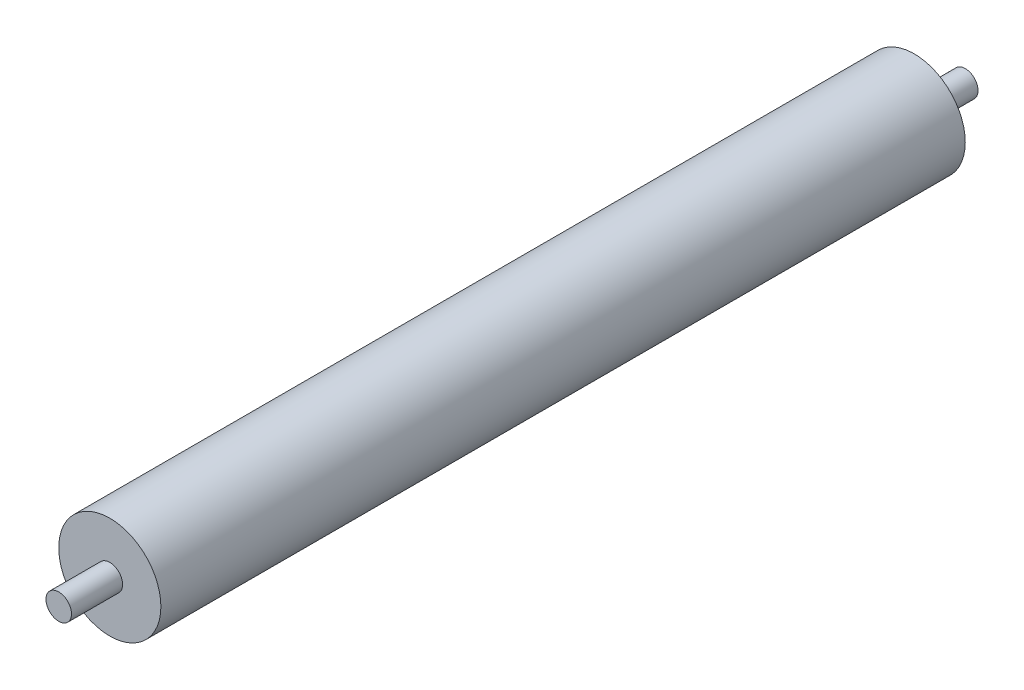
ISO-10303-21;
HEADER;
FILE_DESCRIPTION(('STEP AP214'),'2;1');
FILE_NAME('part.step','',(''),(''),'','','');
FILE_SCHEMA(('AUTOMOTIVE_DESIGN { 1 0 10303 214 1 1 1 1 }'));
ENDSEC;
DATA;
#1=APPLICATION_CONTEXT('core data for automotive mechanical design processes');
#2=APPLICATION_PROTOCOL_DEFINITION('international standard','automotive_design',2000,#1);
#3=PRODUCT_CONTEXT('',#1,'mechanical');
#4=PRODUCT('Part','Part','',(#3));
#5=PRODUCT_RELATED_PRODUCT_CATEGORY('part','',(#4));
#6=PRODUCT_DEFINITION_FORMATION('','',#4);
#7=PRODUCT_DEFINITION_CONTEXT('part definition',#1,'design');
#8=PRODUCT_DEFINITION('design','',#6,#7);
#9=PRODUCT_DEFINITION_SHAPE('','',#8);
#10=(LENGTH_UNIT() NAMED_UNIT(*) SI_UNIT(.MILLI.,.METRE.));
#11=(NAMED_UNIT(*) PLANE_ANGLE_UNIT() SI_UNIT($,.RADIAN.));
#12=(NAMED_UNIT(*) SI_UNIT($,.STERADIAN.) SOLID_ANGLE_UNIT());
#13=UNCERTAINTY_MEASURE_WITH_UNIT(LENGTH_MEASURE(1.E-05),#10,'distance_accuracy_value','');
#14=(GEOMETRIC_REPRESENTATION_CONTEXT(3) GLOBAL_UNCERTAINTY_ASSIGNED_CONTEXT((#13)) GLOBAL_UNIT_ASSIGNED_CONTEXT((#10,
#11,#12)) REPRESENTATION_CONTEXT('',''));
#15=CARTESIAN_POINT('',(0.,0.,0.));
#16=DIRECTION('',(0.,0.,1.));
#17=DIRECTION('',(1.,0.,0.));
#18=AXIS2_PLACEMENT_3D('',#15,#16,#17);
#19=CARTESIAN_POINT('',(0.,0.,315.));
#20=DIRECTION('',(0.,0.,-1.));
#21=DIRECTION('',(-1.,0.,0.));
#22=AXIS2_PLACEMENT_3D('',#19,#20,#21);
#23=CYLINDRICAL_SURFACE('',#22,20.);
#24=CARTESIAN_POINT('',(0.,0.,315.));
#25=DIRECTION('',(0.,0.,1.));
#26=DIRECTION('',(1.,0.,0.));
#27=AXIS2_PLACEMENT_3D('',#24,#25,#26);
#28=CIRCLE('',#27,20.);
#29=CARTESIAN_POINT('',(20.,0.,315.));
#30=VERTEX_POINT('',#29);
#31=EDGE_CURVE('E44',#30,#30,#28,.T.);
#32=ORIENTED_EDGE('',*,*,#31,.F.);
#33=EDGE_LOOP('',(#32));
#34=FACE_BOUND('',#33,.T.);
#35=CARTESIAN_POINT('',(0.,0.,0.));
#36=DIRECTION('',(0.,0.,1.));
#37=DIRECTION('',(1.,0.,0.));
#38=AXIS2_PLACEMENT_3D('',#35,#36,#37);
#39=CIRCLE('',#38,20.);
#40=CARTESIAN_POINT('',(20.,0.,0.));
#41=VERTEX_POINT('',#40);
#42=EDGE_CURVE('E35',#41,#41,#39,.T.);
#43=ORIENTED_EDGE('',*,*,#42,.T.);
#44=EDGE_LOOP('',(#43));
#45=FACE_BOUND('',#44,.T.);
#46=ADVANCED_FACE('F32',(#34,#45),#23,.T.);
#47=CARTESIAN_POINT('',(0.,0.,315.));
#48=DIRECTION('',(0.,0.,1.));
#49=DIRECTION('',(1.,0.,0.));
#50=AXIS2_PLACEMENT_3D('',#47,#48,#49);
#51=PLANE('',#50);
#52=CARTESIAN_POINT('',(0.,0.,315.));
#53=DIRECTION('',(0.,0.,1.));
#54=DIRECTION('',(1.,0.,0.));
#55=AXIS2_PLACEMENT_3D('',#52,#53,#54);
#56=CIRCLE('',#55,5.);
#57=CARTESIAN_POINT('',(5.,0.,315.));
#58=VERTEX_POINT('',#57);
#59=EDGE_CURVE('E39',#58,#58,#56,.T.);
#60=ORIENTED_EDGE('',*,*,#59,.F.);
#61=EDGE_LOOP('',(#60));
#62=FACE_BOUND('',#61,.T.);
#63=ORIENTED_EDGE('',*,*,#31,.T.);
#64=EDGE_LOOP('',(#63));
#65=FACE_BOUND('',#64,.T.);
#66=ADVANCED_FACE('F61',(#62,#65),#51,.T.);
#67=CARTESIAN_POINT('',(0.,0.,0.));
#68=DIRECTION('',(0.,0.,1.));
#69=DIRECTION('',(1.,0.,0.));
#70=AXIS2_PLACEMENT_3D('',#67,#68,#69);
#71=PLANE('',#70);
#72=CARTESIAN_POINT('',(0.,0.,0.));
#73=DIRECTION('',(0.,0.,-1.));
#74=DIRECTION('',(-1.,0.,0.));
#75=AXIS2_PLACEMENT_3D('',#72,#73,#74);
#76=CIRCLE('',#75,5.);
#77=CARTESIAN_POINT('',(-5.,0.,0.));
#78=VERTEX_POINT('',#77);
#79=EDGE_CURVE('E10',#78,#78,#76,.T.);
#80=ORIENTED_EDGE('',*,*,#79,.F.);
#81=EDGE_LOOP('',(#80));
#82=FACE_BOUND('',#81,.T.);
#83=ORIENTED_EDGE('',*,*,#42,.F.);
#84=EDGE_LOOP('',(#83));
#85=FACE_BOUND('',#84,.T.);
#86=ADVANCED_FACE('F58',(#82,#85),#71,.F.);
#87=CARTESIAN_POINT('',(0.,0.,335.));
#88=DIRECTION('',(0.,0.,-1.));
#89=DIRECTION('',(-1.,0.,0.));
#90=AXIS2_PLACEMENT_3D('',#87,#88,#89);
#91=CYLINDRICAL_SURFACE('',#90,5.);
#92=CARTESIAN_POINT('',(0.,0.,335.));
#93=DIRECTION('',(0.,0.,1.));
#94=DIRECTION('',(1.,0.,0.));
#95=AXIS2_PLACEMENT_3D('',#92,#93,#94);
#96=CIRCLE('',#95,5.);
#97=CARTESIAN_POINT('',(5.,0.,335.));
#98=VERTEX_POINT('',#97);
#99=EDGE_CURVE('E49',#98,#98,#96,.T.);
#100=ORIENTED_EDGE('',*,*,#99,.F.);
#101=EDGE_LOOP('',(#100));
#102=FACE_BOUND('',#101,.T.);
#103=ORIENTED_EDGE('',*,*,#59,.T.);
#104=EDGE_LOOP('',(#103));
#105=FACE_BOUND('',#104,.T.);
#106=ADVANCED_FACE('F60',(#102,#105),#91,.T.);
#107=CARTESIAN_POINT('',(0.,0.,335.));
#108=DIRECTION('',(0.,0.,1.));
#109=DIRECTION('',(1.,0.,0.));
#110=AXIS2_PLACEMENT_3D('',#107,#108,#109);
#111=PLANE('',#110);
#112=ORIENTED_EDGE('',*,*,#99,.T.);
#113=EDGE_LOOP('',(#112));
#114=FACE_BOUND('',#113,.T.);
#115=ADVANCED_FACE('F67',(#114),#111,.T.);
#116=CARTESIAN_POINT('',(0.,0.,-20.));
#117=DIRECTION('',(0.,0.,1.));
#118=DIRECTION('',(1.,0.,0.));
#119=AXIS2_PLACEMENT_3D('',#116,#117,#118);
#120=CYLINDRICAL_SURFACE('',#119,5.);
#121=CARTESIAN_POINT('',(0.,0.,-20.));
#122=DIRECTION('',(0.,0.,-1.));
#123=DIRECTION('',(-1.,0.,0.));
#124=AXIS2_PLACEMENT_3D('',#121,#122,#123);
#125=CIRCLE('',#124,5.);
#126=CARTESIAN_POINT('',(-5.,0.,-20.));
#127=VERTEX_POINT('',#126);
#128=EDGE_CURVE('E48',#127,#127,#125,.T.);
#129=ORIENTED_EDGE('',*,*,#128,.F.);
#130=EDGE_LOOP('',(#129));
#131=FACE_BOUND('',#130,.T.);
#132=ORIENTED_EDGE('',*,*,#79,.T.);
#133=EDGE_LOOP('',(#132));
#134=FACE_BOUND('',#133,.T.);
#135=ADVANCED_FACE('F99',(#131,#134),#120,.T.);
#136=CARTESIAN_POINT('',(0.,0.,-20.));
#137=DIRECTION('',(0.,0.,-1.));
#138=DIRECTION('',(-1.,0.,0.));
#139=AXIS2_PLACEMENT_3D('',#136,#137,#138);
#140=PLANE('',#139);
#141=ORIENTED_EDGE('',*,*,#128,.T.);
#142=EDGE_LOOP('',(#141));
#143=FACE_BOUND('',#142,.T.);
#144=ADVANCED_FACE('F104',(#143),#140,.T.);
#145=CLOSED_SHELL('',(#46,#66,#86,#106,#115,#135,#144));
#146=MANIFOLD_SOLID_BREP('B2',#145);
#147=ADVANCED_BREP_SHAPE_REPRESENTATION('',(#18,#146),#14);
#148=SHAPE_DEFINITION_REPRESENTATION(#9,#147);
ENDSEC;
END-ISO-10303-21;
